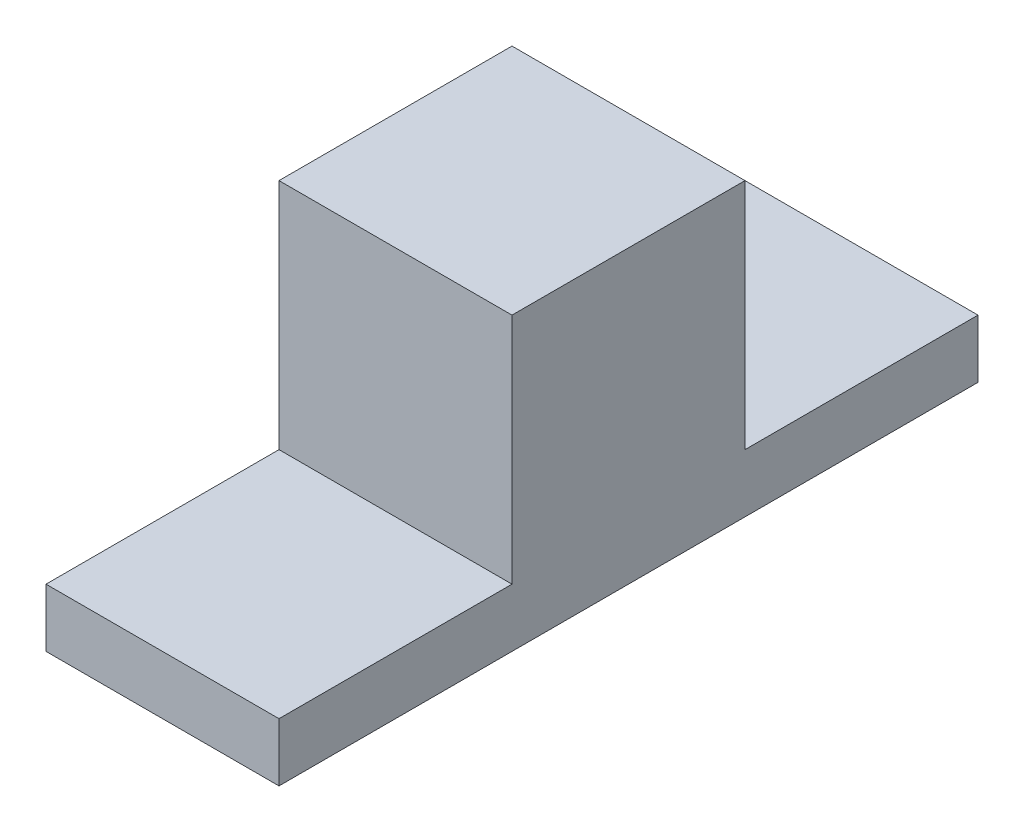
ISO-10303-21;
HEADER;
FILE_DESCRIPTION(('STEP AP214'),'2;1');
FILE_NAME('part.step','',(''),(''),'','','');
FILE_SCHEMA(('AUTOMOTIVE_DESIGN { 1 0 10303 214 1 1 1 1 }'));
ENDSEC;
DATA;
#1=APPLICATION_CONTEXT('core data for automotive mechanical design processes');
#2=APPLICATION_PROTOCOL_DEFINITION('international standard','automotive_design',2000,#1);
#3=PRODUCT_CONTEXT('',#1,'mechanical');
#4=PRODUCT('Part','Part','',(#3));
#5=PRODUCT_RELATED_PRODUCT_CATEGORY('part','',(#4));
#6=PRODUCT_DEFINITION_FORMATION('','',#4);
#7=PRODUCT_DEFINITION_CONTEXT('part definition',#1,'design');
#8=PRODUCT_DEFINITION('design','',#6,#7);
#9=PRODUCT_DEFINITION_SHAPE('','',#8);
#10=(LENGTH_UNIT() NAMED_UNIT(*) SI_UNIT(.MILLI.,.METRE.));
#11=(NAMED_UNIT(*) PLANE_ANGLE_UNIT() SI_UNIT($,.RADIAN.));
#12=(NAMED_UNIT(*) SI_UNIT($,.STERADIAN.) SOLID_ANGLE_UNIT());
#13=UNCERTAINTY_MEASURE_WITH_UNIT(LENGTH_MEASURE(1.E-05),#10,'distance_accuracy_value','');
#14=(GEOMETRIC_REPRESENTATION_CONTEXT(3) GLOBAL_UNCERTAINTY_ASSIGNED_CONTEXT((#13)) GLOBAL_UNIT_ASSIGNED_CONTEXT((#10,
#11,#12)) REPRESENTATION_CONTEXT('',''));
#15=CARTESIAN_POINT('',(0.,0.,0.));
#16=DIRECTION('',(0.,0.,1.));
#17=DIRECTION('',(1.,0.,0.));
#18=AXIS2_PLACEMENT_3D('',#15,#16,#17);
#19=CARTESIAN_POINT('',(6.35,0.,9.525));
#20=DIRECTION('',(0.,0.,-1.));
#21=DIRECTION('',(0.,1.,0.));
#22=AXIS2_PLACEMENT_3D('',#19,#20,#21);
#23=PLANE('',#22);
#24=DIRECTION('',(0.,-1.,0.));
#25=VECTOR('',#24,1.);
#26=CARTESIAN_POINT('',(0.,0.,9.525));
#27=LINE('',#26,#25);
#28=CARTESIAN_POINT('',(0.,0.,9.525));
#29=VERTEX_POINT('',#28);
#30=CARTESIAN_POINT('',(0.,-1.5875,9.525));
#31=VERTEX_POINT('',#30);
#32=EDGE_CURVE('E132',#29,#31,#27,.T.);
#33=ORIENTED_EDGE('',*,*,#32,.T.);
#34=DIRECTION('',(-1.,0.,0.));
#35=VECTOR('',#34,1.);
#36=CARTESIAN_POINT('',(6.35,-1.5875,9.525));
#37=LINE('',#36,#35);
#38=CARTESIAN_POINT('',(6.35,-1.5875,9.525));
#39=VERTEX_POINT('',#38);
#40=EDGE_CURVE('E11',#39,#31,#37,.T.);
#41=ORIENTED_EDGE('',*,*,#40,.F.);
#42=DIRECTION('',(0.,-1.,0.));
#43=VECTOR('',#42,1.);
#44=CARTESIAN_POINT('',(6.35,0.,9.525));
#45=LINE('',#44,#43);
#46=CARTESIAN_POINT('',(6.35,0.,9.525));
#47=VERTEX_POINT('',#46);
#48=EDGE_CURVE('E146',#47,#39,#45,.T.);
#49=ORIENTED_EDGE('',*,*,#48,.F.);
#50=DIRECTION('',(-1.,0.,0.));
#51=VECTOR('',#50,1.);
#52=CARTESIAN_POINT('',(6.35,0.,9.525));
#53=LINE('',#52,#51);
#54=EDGE_CURVE('E128',#47,#29,#53,.T.);
#55=ORIENTED_EDGE('',*,*,#54,.T.);
#56=EDGE_LOOP('',(#33,#41,#49,#55));
#57=FACE_BOUND('',#56,.T.);
#58=ADVANCED_FACE('F36',(#57),#23,.F.);
#59=CARTESIAN_POINT('',(6.35,-1.5875,9.525));
#60=DIRECTION('',(0.,1.,0.));
#61=DIRECTION('',(0.,0.,1.));
#62=AXIS2_PLACEMENT_3D('',#59,#60,#61);
#63=PLANE('',#62);
#64=DIRECTION('',(0.,0.,-1.));
#65=VECTOR('',#64,1.);
#66=CARTESIAN_POINT('',(0.,-1.5875,9.525));
#67=LINE('',#66,#65);
#68=CARTESIAN_POINT('',(0.,-1.5875,-9.525));
#69=VERTEX_POINT('',#68);
#70=EDGE_CURVE('E135',#31,#69,#67,.T.);
#71=ORIENTED_EDGE('',*,*,#70,.T.);
#72=DIRECTION('',(-1.,0.,0.));
#73=VECTOR('',#72,1.);
#74=CARTESIAN_POINT('',(6.35,-1.5875,-9.525));
#75=LINE('',#74,#73);
#76=CARTESIAN_POINT('',(6.35,-1.5875,-9.525));
#77=VERTEX_POINT('',#76);
#78=EDGE_CURVE('E44',#77,#69,#75,.T.);
#79=ORIENTED_EDGE('',*,*,#78,.F.);
#80=DIRECTION('',(0.,0.,-1.));
#81=VECTOR('',#80,1.);
#82=CARTESIAN_POINT('',(6.35,-1.5875,9.525));
#83=LINE('',#82,#81);
#84=EDGE_CURVE('E95',#39,#77,#83,.T.);
#85=ORIENTED_EDGE('',*,*,#84,.F.);
#86=ORIENTED_EDGE('',*,*,#40,.T.);
#87=EDGE_LOOP('',(#71,#79,#85,#86));
#88=FACE_BOUND('',#87,.T.);
#89=ADVANCED_FACE('F181',(#88),#63,.F.);
#90=CARTESIAN_POINT('',(6.35,0.,-9.525));
#91=DIRECTION('',(0.,0.,1.));
#92=DIRECTION('',(0.,-1.,0.));
#93=AXIS2_PLACEMENT_3D('',#90,#91,#92);
#94=PLANE('',#93);
#95=DIRECTION('',(0.,1.,0.));
#96=VECTOR('',#95,1.);
#97=CARTESIAN_POINT('',(0.,0.,-9.525));
#98=LINE('',#97,#96);
#99=CARTESIAN_POINT('',(0.,0.,-9.525));
#100=VERTEX_POINT('',#99);
#101=EDGE_CURVE('E137',#69,#100,#98,.T.);
#102=ORIENTED_EDGE('',*,*,#101,.T.);
#103=DIRECTION('',(-1.,0.,0.));
#104=VECTOR('',#103,1.);
#105=CARTESIAN_POINT('',(6.35,0.,-9.525));
#106=LINE('',#105,#104);
#107=CARTESIAN_POINT('',(6.35,0.,-9.525));
#108=VERTEX_POINT('',#107);
#109=EDGE_CURVE('E153',#108,#100,#106,.T.);
#110=ORIENTED_EDGE('',*,*,#109,.F.);
#111=DIRECTION('',(0.,1.,0.));
#112=VECTOR('',#111,1.);
#113=CARTESIAN_POINT('',(6.35,0.,-9.525));
#114=LINE('',#113,#112);
#115=EDGE_CURVE('E161',#77,#108,#114,.T.);
#116=ORIENTED_EDGE('',*,*,#115,.F.);
#117=ORIENTED_EDGE('',*,*,#78,.T.);
#118=EDGE_LOOP('',(#102,#110,#116,#117));
#119=FACE_BOUND('',#118,.T.);
#120=ADVANCED_FACE('F159',(#119),#94,.F.);
#121=CARTESIAN_POINT('',(6.35,0.,-3.175));
#122=DIRECTION('',(0.,-1.,0.));
#123=DIRECTION('',(0.,0.,-1.));
#124=AXIS2_PLACEMENT_3D('',#121,#122,#123);
#125=PLANE('',#124);
#126=DIRECTION('',(0.,0.,1.));
#127=VECTOR('',#126,1.);
#128=CARTESIAN_POINT('',(0.,0.,-3.175));
#129=LINE('',#128,#127);
#130=CARTESIAN_POINT('',(0.,0.,-3.175));
#131=VERTEX_POINT('',#130);
#132=EDGE_CURVE('E139',#100,#131,#129,.T.);
#133=ORIENTED_EDGE('',*,*,#132,.T.);
#134=DIRECTION('',(-1.,0.,0.));
#135=VECTOR('',#134,1.);
#136=CARTESIAN_POINT('',(6.35,0.,-3.175));
#137=LINE('',#136,#135);
#138=CARTESIAN_POINT('',(6.35,0.,-3.175));
#139=VERTEX_POINT('',#138);
#140=EDGE_CURVE('E150',#139,#131,#137,.T.);
#141=ORIENTED_EDGE('',*,*,#140,.F.);
#142=DIRECTION('',(0.,0.,1.));
#143=VECTOR('',#142,1.);
#144=CARTESIAN_POINT('',(6.35,0.,-3.175));
#145=LINE('',#144,#143);
#146=EDGE_CURVE('E173',#108,#139,#145,.T.);
#147=ORIENTED_EDGE('',*,*,#146,.F.);
#148=ORIENTED_EDGE('',*,*,#109,.T.);
#149=EDGE_LOOP('',(#133,#141,#147,#148));
#150=FACE_BOUND('',#149,.T.);
#151=ADVANCED_FACE('F169',(#150),#125,.F.);
#152=CARTESIAN_POINT('',(6.35,0.,-3.175));
#153=DIRECTION('',(0.,0.,1.));
#154=DIRECTION('',(1.,0.,0.));
#155=AXIS2_PLACEMENT_3D('',#152,#153,#154);
#156=PLANE('',#155);
#157=DIRECTION('',(0.,1.,0.));
#158=VECTOR('',#157,1.);
#159=CARTESIAN_POINT('',(0.,0.,-3.175));
#160=LINE('',#159,#158);
#161=CARTESIAN_POINT('',(0.,6.35,-3.175));
#162=VERTEX_POINT('',#161);
#163=EDGE_CURVE('E141',#131,#162,#160,.T.);
#164=ORIENTED_EDGE('',*,*,#163,.T.);
#165=DIRECTION('',(-1.,0.,0.));
#166=VECTOR('',#165,1.);
#167=CARTESIAN_POINT('',(6.35,6.35,-3.175));
#168=LINE('',#167,#166);
#169=CARTESIAN_POINT('',(6.35,6.35,-3.175));
#170=VERTEX_POINT('',#169);
#171=EDGE_CURVE('E123',#170,#162,#168,.T.);
#172=ORIENTED_EDGE('',*,*,#171,.F.);
#173=DIRECTION('',(0.,1.,0.));
#174=VECTOR('',#173,1.);
#175=CARTESIAN_POINT('',(6.35,0.,-3.175));
#176=LINE('',#175,#174);
#177=EDGE_CURVE('E114',#139,#170,#176,.T.);
#178=ORIENTED_EDGE('',*,*,#177,.F.);
#179=ORIENTED_EDGE('',*,*,#140,.T.);
#180=EDGE_LOOP('',(#164,#172,#178,#179));
#181=FACE_BOUND('',#180,.T.);
#182=ADVANCED_FACE('F172',(#181),#156,.F.);
#183=CARTESIAN_POINT('',(6.35,6.35,-3.175));
#184=DIRECTION('',(0.,-1.,0.));
#185=DIRECTION('',(0.,0.,-1.));
#186=AXIS2_PLACEMENT_3D('',#183,#184,#185);
#187=PLANE('',#186);
#188=DIRECTION('',(0.,0.,1.));
#189=VECTOR('',#188,1.);
#190=CARTESIAN_POINT('',(0.,6.35,-3.175));
#191=LINE('',#190,#189);
#192=CARTESIAN_POINT('',(0.,6.35,3.175));
#193=VERTEX_POINT('',#192);
#194=EDGE_CURVE('E122',#162,#193,#191,.T.);
#195=ORIENTED_EDGE('',*,*,#194,.T.);
#196=DIRECTION('',(-1.,0.,0.));
#197=VECTOR('',#196,1.);
#198=CARTESIAN_POINT('',(6.35,6.35,3.175));
#199=LINE('',#198,#197);
#200=CARTESIAN_POINT('',(6.35,6.35,3.175));
#201=VERTEX_POINT('',#200);
#202=EDGE_CURVE('E119',#201,#193,#199,.T.);
#203=ORIENTED_EDGE('',*,*,#202,.F.);
#204=DIRECTION('',(0.,0.,1.));
#205=VECTOR('',#204,1.);
#206=CARTESIAN_POINT('',(6.35,6.35,-3.175));
#207=LINE('',#206,#205);
#208=EDGE_CURVE('E108',#170,#201,#207,.T.);
#209=ORIENTED_EDGE('',*,*,#208,.F.);
#210=ORIENTED_EDGE('',*,*,#171,.T.);
#211=EDGE_LOOP('',(#195,#203,#209,#210));
#212=FACE_BOUND('',#211,.T.);
#213=ADVANCED_FACE('F120',(#212),#187,.F.);
#214=CARTESIAN_POINT('',(6.35,0.,3.175));
#215=DIRECTION('',(0.,0.,-1.));
#216=DIRECTION('',(-1.,0.,0.));
#217=AXIS2_PLACEMENT_3D('',#214,#215,#216);
#218=PLANE('',#217);
#219=DIRECTION('',(0.,-1.,0.));
#220=VECTOR('',#219,1.);
#221=CARTESIAN_POINT('',(0.,0.,3.175));
#222=LINE('',#221,#220);
#223=CARTESIAN_POINT('',(0.,0.,3.175));
#224=VERTEX_POINT('',#223);
#225=EDGE_CURVE('E81',#193,#224,#222,.T.);
#226=ORIENTED_EDGE('',*,*,#225,.T.);
#227=DIRECTION('',(-1.,0.,0.));
#228=VECTOR('',#227,1.);
#229=CARTESIAN_POINT('',(6.35,0.,3.175));
#230=LINE('',#229,#228);
#231=CARTESIAN_POINT('',(6.35,0.,3.175));
#232=VERTEX_POINT('',#231);
#233=EDGE_CURVE('E124',#232,#224,#230,.T.);
#234=ORIENTED_EDGE('',*,*,#233,.F.);
#235=DIRECTION('',(0.,-1.,0.));
#236=VECTOR('',#235,1.);
#237=CARTESIAN_POINT('',(6.35,0.,3.175));
#238=LINE('',#237,#236);
#239=EDGE_CURVE('E112',#201,#232,#238,.T.);
#240=ORIENTED_EDGE('',*,*,#239,.F.);
#241=ORIENTED_EDGE('',*,*,#202,.T.);
#242=EDGE_LOOP('',(#226,#234,#240,#241));
#243=FACE_BOUND('',#242,.T.);
#244=ADVANCED_FACE('F126',(#243),#218,.F.);
#245=CARTESIAN_POINT('',(6.35,0.,9.525));
#246=DIRECTION('',(0.,-1.,0.));
#247=DIRECTION('',(0.,0.,-1.));
#248=AXIS2_PLACEMENT_3D('',#245,#246,#247);
#249=PLANE('',#248);
#250=DIRECTION('',(0.,0.,1.));
#251=VECTOR('',#250,1.);
#252=CARTESIAN_POINT('',(0.,0.,9.525));
#253=LINE('',#252,#251);
#254=EDGE_CURVE('E87',#224,#29,#253,.T.);
#255=ORIENTED_EDGE('',*,*,#254,.T.);
#256=ORIENTED_EDGE('',*,*,#54,.F.);
#257=DIRECTION('',(0.,0.,1.));
#258=VECTOR('',#257,1.);
#259=CARTESIAN_POINT('',(6.35,0.,9.525));
#260=LINE('',#259,#258);
#261=EDGE_CURVE('E52',#232,#47,#260,.T.);
#262=ORIENTED_EDGE('',*,*,#261,.F.);
#263=ORIENTED_EDGE('',*,*,#233,.T.);
#264=EDGE_LOOP('',(#255,#256,#262,#263));
#265=FACE_BOUND('',#264,.T.);
#266=ADVANCED_FACE('F197',(#265),#249,.F.);
#267=CARTESIAN_POINT('',(6.35,0.,0.));
#268=DIRECTION('',(1.,0.,0.));
#269=DIRECTION('',(0.,0.,-1.));
#270=AXIS2_PLACEMENT_3D('',#267,#268,#269);
#271=PLANE('',#270);
#272=ORIENTED_EDGE('',*,*,#48,.T.);
#273=ORIENTED_EDGE('',*,*,#84,.T.);
#274=ORIENTED_EDGE('',*,*,#115,.T.);
#275=ORIENTED_EDGE('',*,*,#146,.T.);
#276=ORIENTED_EDGE('',*,*,#177,.T.);
#277=ORIENTED_EDGE('',*,*,#208,.T.);
#278=ORIENTED_EDGE('',*,*,#239,.T.);
#279=ORIENTED_EDGE('',*,*,#261,.T.);
#280=EDGE_LOOP('',(#272,#273,#274,#275,#276,#277,#278,#279));
#281=FACE_BOUND('',#280,.T.);
#282=ADVANCED_FACE('F110',(#281),#271,.T.);
#283=CARTESIAN_POINT('',(0.,0.,0.));
#284=DIRECTION('',(1.,0.,0.));
#285=DIRECTION('',(0.,0.,-1.));
#286=AXIS2_PLACEMENT_3D('',#283,#284,#285);
#287=PLANE('',#286);
#288=ORIENTED_EDGE('',*,*,#32,.F.);
#289=ORIENTED_EDGE('',*,*,#254,.F.);
#290=ORIENTED_EDGE('',*,*,#225,.F.);
#291=ORIENTED_EDGE('',*,*,#194,.F.);
#292=ORIENTED_EDGE('',*,*,#163,.F.);
#293=ORIENTED_EDGE('',*,*,#132,.F.);
#294=ORIENTED_EDGE('',*,*,#101,.F.);
#295=ORIENTED_EDGE('',*,*,#70,.F.);
#296=EDGE_LOOP('',(#288,#289,#290,#291,#292,#293,#294,#295));
#297=FACE_BOUND('',#296,.T.);
#298=ADVANCED_FACE('F165',(#297),#287,.F.);
#299=CLOSED_SHELL('',(#58,#89,#120,#151,#182,#213,#244,#266,#282,#298));
#300=MANIFOLD_SOLID_BREP('B2',#299);
#301=ADVANCED_BREP_SHAPE_REPRESENTATION('',(#18,#300),#14);
#302=SHAPE_DEFINITION_REPRESENTATION(#9,#301);
ENDSEC;
END-ISO-10303-21;
